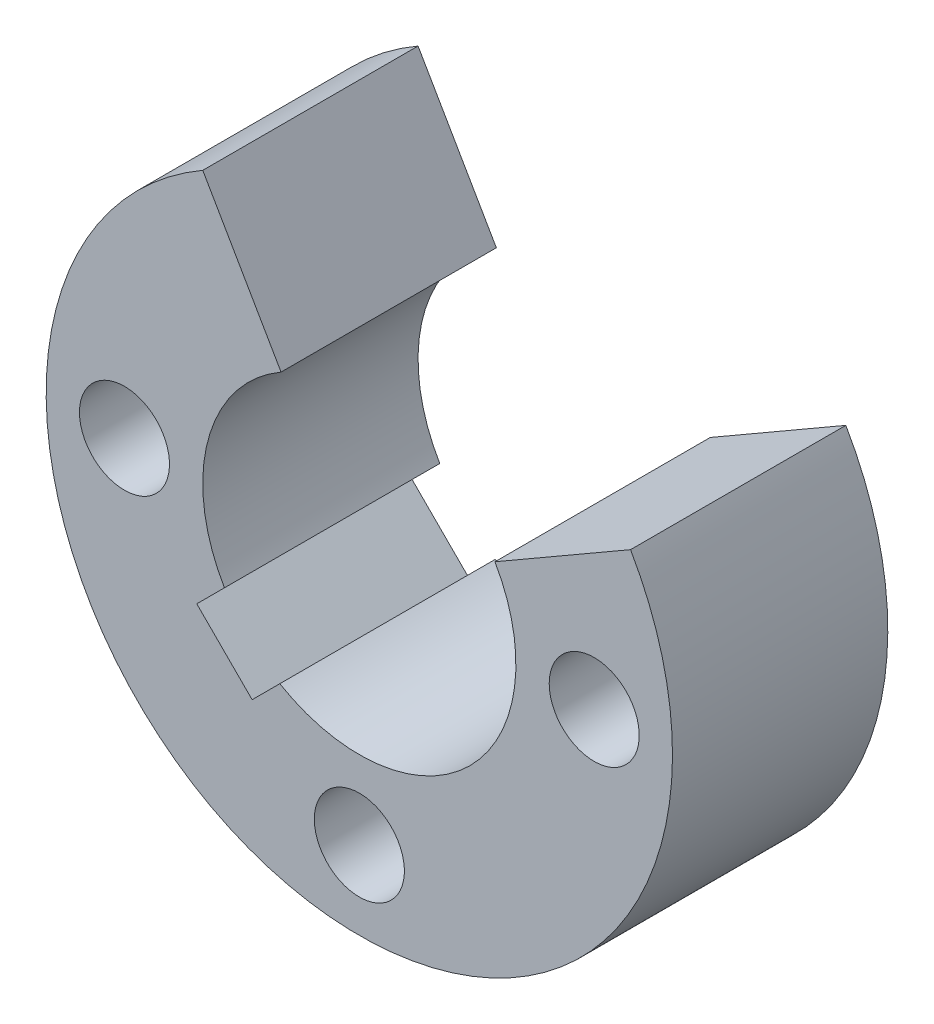
ISO-10303-21;
HEADER;
FILE_DESCRIPTION(('STEP AP214'),'2;1');
FILE_NAME('part.step','',(''),(''),'','','');
FILE_SCHEMA(('AUTOMOTIVE_DESIGN { 1 0 10303 214 1 1 1 1 }'));
ENDSEC;
DATA;
#1=APPLICATION_CONTEXT('core data for automotive mechanical design processes');
#2=APPLICATION_PROTOCOL_DEFINITION('international standard','automotive_design',2000,#1);
#3=PRODUCT_CONTEXT('',#1,'mechanical');
#4=PRODUCT('Part','Part','',(#3));
#5=PRODUCT_RELATED_PRODUCT_CATEGORY('part','',(#4));
#6=PRODUCT_DEFINITION_FORMATION('','',#4);
#7=PRODUCT_DEFINITION_CONTEXT('part definition',#1,'design');
#8=PRODUCT_DEFINITION('design','',#6,#7);
#9=PRODUCT_DEFINITION_SHAPE('','',#8);
#10=(LENGTH_UNIT() NAMED_UNIT(*) SI_UNIT(.MILLI.,.METRE.));
#11=(NAMED_UNIT(*) PLANE_ANGLE_UNIT() SI_UNIT($,.RADIAN.));
#12=(NAMED_UNIT(*) SI_UNIT($,.STERADIAN.) SOLID_ANGLE_UNIT());
#13=UNCERTAINTY_MEASURE_WITH_UNIT(LENGTH_MEASURE(1.E-05),#10,'distance_accuracy_value','');
#14=(GEOMETRIC_REPRESENTATION_CONTEXT(3) GLOBAL_UNCERTAINTY_ASSIGNED_CONTEXT((#13)) GLOBAL_UNIT_ASSIGNED_CONTEXT((#10,
#11,#12)) REPRESENTATION_CONTEXT('',''));
#15=CARTESIAN_POINT('',(0.,0.,0.));
#16=DIRECTION('',(0.,0.,1.));
#17=DIRECTION('',(1.,0.,0.));
#18=AXIS2_PLACEMENT_3D('',#15,#16,#17);
#19=CARTESIAN_POINT('',(-6.,0.,8.));
#20=DIRECTION('',(0.,0.,-1.));
#21=DIRECTION('',(-1.,0.,0.));
#22=AXIS2_PLACEMENT_3D('',#19,#20,#21);
#23=CYLINDRICAL_SURFACE('',#22,1.15);
#24=CARTESIAN_POINT('',(-6.,0.,2.5));
#25=DIRECTION('',(0.,0.,-1.));
#26=DIRECTION('',(-1.,0.,0.));
#27=AXIS2_PLACEMENT_3D('',#24,#25,#26);
#28=CIRCLE('',#27,1.15);
#29=CARTESIAN_POINT('',(-7.15,0.,2.5));
#30=VERTEX_POINT('',#29);
#31=EDGE_CURVE('E39',#30,#30,#28,.T.);
#32=ORIENTED_EDGE('',*,*,#31,.F.);
#33=EDGE_LOOP('',(#32));
#34=FACE_BOUND('',#33,.T.);
#35=CARTESIAN_POINT('',(-6.,0.,-3.));
#36=DIRECTION('',(0.,0.,-1.));
#37=DIRECTION('',(-1.,0.,0.));
#38=AXIS2_PLACEMENT_3D('',#35,#36,#37);
#39=CIRCLE('',#38,1.15);
#40=CARTESIAN_POINT('',(-7.15,0.,-3.));
#41=VERTEX_POINT('',#40);
#42=EDGE_CURVE('E167',#41,#41,#39,.T.);
#43=ORIENTED_EDGE('',*,*,#42,.T.);
#44=EDGE_LOOP('',(#43));
#45=FACE_BOUND('',#44,.T.);
#46=ADVANCED_FACE('F35',(#34,#45),#23,.F.);
#47=CARTESIAN_POINT('',(0.,-6.,8.));
#48=DIRECTION('',(0.,0.,-1.));
#49=DIRECTION('',(-1.,0.,0.));
#50=AXIS2_PLACEMENT_3D('',#47,#48,#49);
#51=CYLINDRICAL_SURFACE('',#50,1.15);
#52=CARTESIAN_POINT('',(0.,-6.,2.5));
#53=DIRECTION('',(0.,0.,-1.));
#54=DIRECTION('',(-1.,0.,0.));
#55=AXIS2_PLACEMENT_3D('',#52,#53,#54);
#56=CIRCLE('',#55,1.15);
#57=CARTESIAN_POINT('',(-1.15,-6.,2.5));
#58=VERTEX_POINT('',#57);
#59=EDGE_CURVE('E176',#58,#58,#56,.T.);
#60=ORIENTED_EDGE('',*,*,#59,.F.);
#61=EDGE_LOOP('',(#60));
#62=FACE_BOUND('',#61,.T.);
#63=CARTESIAN_POINT('',(0.,-6.,-3.));
#64=DIRECTION('',(0.,0.,-1.));
#65=DIRECTION('',(-1.,0.,0.));
#66=AXIS2_PLACEMENT_3D('',#63,#64,#65);
#67=CIRCLE('',#66,1.15);
#68=CARTESIAN_POINT('',(-1.15,-6.,-3.));
#69=VERTEX_POINT('',#68);
#70=EDGE_CURVE('E170',#69,#69,#67,.T.);
#71=ORIENTED_EDGE('',*,*,#70,.T.);
#72=EDGE_LOOP('',(#71));
#73=FACE_BOUND('',#72,.T.);
#74=ADVANCED_FACE('F186',(#62,#73),#51,.F.);
#75=CARTESIAN_POINT('',(6.,0.,8.));
#76=DIRECTION('',(0.,0.,-1.));
#77=DIRECTION('',(-1.,0.,0.));
#78=AXIS2_PLACEMENT_3D('',#75,#76,#77);
#79=CYLINDRICAL_SURFACE('',#78,1.15);
#80=CARTESIAN_POINT('',(6.,0.,2.5));
#81=DIRECTION('',(0.,0.,-1.));
#82=DIRECTION('',(-1.,0.,0.));
#83=AXIS2_PLACEMENT_3D('',#80,#81,#82);
#84=CIRCLE('',#83,1.15);
#85=CARTESIAN_POINT('',(4.85,0.,2.5));
#86=VERTEX_POINT('',#85);
#87=EDGE_CURVE('E154',#86,#86,#84,.T.);
#88=ORIENTED_EDGE('',*,*,#87,.F.);
#89=EDGE_LOOP('',(#88));
#90=FACE_BOUND('',#89,.T.);
#91=CARTESIAN_POINT('',(6.,0.,-3.));
#92=DIRECTION('',(0.,0.,-1.));
#93=DIRECTION('',(-1.,0.,0.));
#94=AXIS2_PLACEMENT_3D('',#91,#92,#93);
#95=CIRCLE('',#94,1.15);
#96=CARTESIAN_POINT('',(4.85,0.,-3.));
#97=VERTEX_POINT('',#96);
#98=EDGE_CURVE('E44',#97,#97,#95,.T.);
#99=ORIENTED_EDGE('',*,*,#98,.T.);
#100=EDGE_LOOP('',(#99));
#101=FACE_BOUND('',#100,.T.);
#102=ADVANCED_FACE('F192',(#90,#101),#79,.F.);
#103=CARTESIAN_POINT('',(0.,0.,-3.));
#104=DIRECTION('',(0.,0.,-1.));
#105=DIRECTION('',(-1.,0.,0.));
#106=AXIS2_PLACEMENT_3D('',#103,#104,#105);
#107=PLANE('',#106);
#108=ORIENTED_EDGE('',*,*,#42,.F.);
#109=EDGE_LOOP('',(#108));
#110=FACE_BOUND('',#109,.T.);
#111=ORIENTED_EDGE('',*,*,#98,.F.);
#112=EDGE_LOOP('',(#111));
#113=FACE_BOUND('',#112,.T.);
#114=ORIENTED_EDGE('',*,*,#70,.F.);
#115=EDGE_LOOP('',(#114));
#116=FACE_BOUND('',#115,.T.);
#117=CARTESIAN_POINT('',(0.,0.,-3.));
#118=DIRECTION('',(0.,0.,-1.));
#119=DIRECTION('',(-1.,0.,0.));
#120=AXIS2_PLACEMENT_3D('',#117,#118,#119);
#121=CIRCLE('',#120,4.);
#122=CARTESIAN_POINT('',(3.46410161513775,2.00000000000001,-3.));
#123=VERTEX_POINT('',#122);
#124=CARTESIAN_POINT('',(-2.0315060063393,-3.44571956871237,-3.));
#125=VERTEX_POINT('',#124);
#126=EDGE_CURVE('E114',#123,#125,#121,.T.);
#127=ORIENTED_EDGE('',*,*,#126,.F.);
#128=DIRECTION('',(0.866025403784438,0.500000000000002,0.));
#129=VECTOR('',#128,1.);
#130=CARTESIAN_POINT('',(0.,0.,-3.));
#131=LINE('',#130,#129);
#132=CARTESIAN_POINT('',(6.9282032302755,4.00000000000002,-3.));
#133=VERTEX_POINT('',#132);
#134=EDGE_CURVE('E144',#123,#133,#131,.T.);
#135=ORIENTED_EDGE('',*,*,#134,.T.);
#136=CARTESIAN_POINT('',(0.,0.,-3.));
#137=DIRECTION('',(0.,0.,-1.));
#138=DIRECTION('',(-1.,0.,0.));
#139=AXIS2_PLACEMENT_3D('',#136,#137,#138);
#140=CIRCLE('',#139,8.);
#141=CARTESIAN_POINT('',(-3.99999999999999,6.92820323027551,-3.));
#142=VERTEX_POINT('',#141);
#143=EDGE_CURVE('E12',#133,#142,#140,.T.);
#144=ORIENTED_EDGE('',*,*,#143,.T.);
#145=DIRECTION('',(0.499999999999999,-0.866025403784439,0.));
#146=VECTOR('',#145,1.);
#147=CARTESIAN_POINT('',(0.,0.,-3.));
#148=LINE('',#147,#146);
#149=CARTESIAN_POINT('',(-2.,3.46410161513776,-3.));
#150=VERTEX_POINT('',#149);
#151=EDGE_CURVE('E141',#142,#150,#148,.T.);
#152=ORIENTED_EDGE('',*,*,#151,.T.);
#153=CARTESIAN_POINT('',(0.,0.,-3.));
#154=DIRECTION('',(0.,0.,-1.));
#155=DIRECTION('',(-1.,0.,0.));
#156=AXIS2_PLACEMENT_3D('',#153,#154,#155);
#157=CIRCLE('',#156,4.);
#158=CARTESIAN_POINT('',(-3.44571956871239,-2.03150600633926,-3.));
#159=VERTEX_POINT('',#158);
#160=EDGE_CURVE('E139',#159,#150,#157,.T.);
#161=ORIENTED_EDGE('',*,*,#160,.F.);
#162=DIRECTION('',(0.707106781186551,0.707106781186545,0.));
#163=VECTOR('',#162,1.);
#164=CARTESIAN_POINT('',(-0.707106781186547,0.707106781186553,-3.));
#165=LINE('',#164,#163);
#166=CARTESIAN_POINT('',(-4.15282634989894,-2.73861278752581,-3.));
#167=VERTEX_POINT('',#166);
#168=EDGE_CURVE('E137',#167,#159,#165,.T.);
#169=ORIENTED_EDGE('',*,*,#168,.F.);
#170=DIRECTION('',(-0.707106781186544,0.707106781186551,0.));
#171=VECTOR('',#170,1.);
#172=CARTESIAN_POINT('',(-3.4457195687124,-3.44571956871236,-3.));
#173=LINE('',#172,#171);
#174=CARTESIAN_POINT('',(-2.73861278752585,-4.15282634989891,-3.));
#175=VERTEX_POINT('',#174);
#176=EDGE_CURVE('E150',#175,#167,#173,.T.);
#177=ORIENTED_EDGE('',*,*,#176,.F.);
#178=DIRECTION('',(-0.707106781186551,-0.707106781186544,0.));
#179=VECTOR('',#178,1.);
#180=CARTESIAN_POINT('',(0.707106781186545,-0.707106781186553,-3.));
#181=LINE('',#180,#179);
#182=EDGE_CURVE('E148',#125,#175,#181,.T.);
#183=ORIENTED_EDGE('',*,*,#182,.F.);
#184=EDGE_LOOP('',(#127,#135,#144,#152,#161,#169,#177,#183));
#185=FACE_BOUND('',#184,.T.);
#186=ADVANCED_FACE('F189',(#110,#113,#116,#185),#107,.T.);
#187=CARTESIAN_POINT('',(0.,0.,2.5));
#188=DIRECTION('',(0.,0.,-1.));
#189=DIRECTION('',(-1.,0.,0.));
#190=AXIS2_PLACEMENT_3D('',#187,#188,#189);
#191=PLANE('',#190);
#192=ORIENTED_EDGE('',*,*,#87,.T.);
#193=EDGE_LOOP('',(#192));
#194=FACE_BOUND('',#193,.T.);
#195=ORIENTED_EDGE('',*,*,#59,.T.);
#196=EDGE_LOOP('',(#195));
#197=FACE_BOUND('',#196,.T.);
#198=ORIENTED_EDGE('',*,*,#31,.T.);
#199=EDGE_LOOP('',(#198));
#200=FACE_BOUND('',#199,.T.);
#201=DIRECTION('',(0.866025403784438,0.500000000000002,0.));
#202=VECTOR('',#201,1.);
#203=CARTESIAN_POINT('',(0.,0.,2.5));
#204=LINE('',#203,#202);
#205=CARTESIAN_POINT('',(3.46410161513775,2.00000000000001,2.5));
#206=VERTEX_POINT('',#205);
#207=CARTESIAN_POINT('',(6.9282032302755,4.00000000000002,2.5));
#208=VERTEX_POINT('',#207);
#209=EDGE_CURVE('E130',#206,#208,#204,.T.);
#210=ORIENTED_EDGE('',*,*,#209,.F.);
#211=CARTESIAN_POINT('',(0.,0.,2.5));
#212=DIRECTION('',(0.,0.,-1.));
#213=DIRECTION('',(-1.,0.,0.));
#214=AXIS2_PLACEMENT_3D('',#211,#212,#213);
#215=CIRCLE('',#214,4.);
#216=CARTESIAN_POINT('',(-2.0315060063393,-3.44571956871237,2.5));
#217=VERTEX_POINT('',#216);
#218=EDGE_CURVE('E111',#206,#217,#215,.T.);
#219=ORIENTED_EDGE('',*,*,#218,.T.);
#220=DIRECTION('',(-0.707106781186551,-0.707106781186544,0.));
#221=VECTOR('',#220,1.);
#222=CARTESIAN_POINT('',(0.707106781186545,-0.707106781186553,2.5));
#223=LINE('',#222,#221);
#224=CARTESIAN_POINT('',(-2.73861278752585,-4.15282634989891,2.5));
#225=VERTEX_POINT('',#224);
#226=EDGE_CURVE('E122',#217,#225,#223,.T.);
#227=ORIENTED_EDGE('',*,*,#226,.T.);
#228=DIRECTION('',(-0.707106781186544,0.707106781186551,0.));
#229=VECTOR('',#228,1.);
#230=CARTESIAN_POINT('',(-3.4457195687124,-3.44571956871236,2.5));
#231=LINE('',#230,#229);
#232=CARTESIAN_POINT('',(-4.15282634989894,-2.73861278752581,2.5));
#233=VERTEX_POINT('',#232);
#234=EDGE_CURVE('E126',#225,#233,#231,.T.);
#235=ORIENTED_EDGE('',*,*,#234,.T.);
#236=DIRECTION('',(0.707106781186551,0.707106781186545,0.));
#237=VECTOR('',#236,1.);
#238=CARTESIAN_POINT('',(-0.707106781186547,0.707106781186553,2.5));
#239=LINE('',#238,#237);
#240=CARTESIAN_POINT('',(-3.44571956871239,-2.03150600633926,2.5));
#241=VERTEX_POINT('',#240);
#242=EDGE_CURVE('E152',#233,#241,#239,.T.);
#243=ORIENTED_EDGE('',*,*,#242,.T.);
#244=CARTESIAN_POINT('',(0.,0.,2.5));
#245=DIRECTION('',(0.,0.,-1.));
#246=DIRECTION('',(-1.,0.,0.));
#247=AXIS2_PLACEMENT_3D('',#244,#245,#246);
#248=CIRCLE('',#247,4.);
#249=CARTESIAN_POINT('',(-2.,3.46410161513776,2.5));
#250=VERTEX_POINT('',#249);
#251=EDGE_CURVE('E207',#241,#250,#248,.T.);
#252=ORIENTED_EDGE('',*,*,#251,.T.);
#253=DIRECTION('',(0.499999999999999,-0.866025403784439,0.));
#254=VECTOR('',#253,1.);
#255=CARTESIAN_POINT('',(0.,0.,2.5));
#256=LINE('',#255,#254);
#257=CARTESIAN_POINT('',(-3.99999999999999,6.92820323027551,2.5));
#258=VERTEX_POINT('',#257);
#259=EDGE_CURVE('E132',#258,#250,#256,.T.);
#260=ORIENTED_EDGE('',*,*,#259,.F.);
#261=CARTESIAN_POINT('',(0.,0.,2.5));
#262=DIRECTION('',(0.,0.,-1.));
#263=DIRECTION('',(-1.,0.,0.));
#264=AXIS2_PLACEMENT_3D('',#261,#262,#263);
#265=CIRCLE('',#264,8.);
#266=EDGE_CURVE('E164',#208,#258,#265,.T.);
#267=ORIENTED_EDGE('',*,*,#266,.F.);
#268=EDGE_LOOP('',(#210,#219,#227,#235,#243,#252,#260,#267));
#269=FACE_BOUND('',#268,.T.);
#270=ADVANCED_FACE('F128',(#194,#197,#200,#269),#191,.F.);
#271=CARTESIAN_POINT('',(0.,0.,8.));
#272=DIRECTION('',(0.,0.,-1.));
#273=DIRECTION('',(-1.,0.,0.));
#274=AXIS2_PLACEMENT_3D('',#271,#272,#273);
#275=CYLINDRICAL_SURFACE('',#274,8.);
#276=DIRECTION('',(0.,0.,-1.));
#277=VECTOR('',#276,1.);
#278=CARTESIAN_POINT('',(6.9282032302755,4.00000000000002,2.5));
#279=LINE('',#278,#277);
#280=EDGE_CURVE('E157',#208,#133,#279,.T.);
#281=ORIENTED_EDGE('',*,*,#280,.F.);
#282=ORIENTED_EDGE('',*,*,#266,.T.);
#283=DIRECTION('',(0.,0.,-1.));
#284=VECTOR('',#283,1.);
#285=CARTESIAN_POINT('',(-3.99999999999999,6.92820323027551,2.5));
#286=LINE('',#285,#284);
#287=EDGE_CURVE('E159',#258,#142,#286,.T.);
#288=ORIENTED_EDGE('',*,*,#287,.T.);
#289=ORIENTED_EDGE('',*,*,#143,.F.);
#290=EDGE_LOOP('',(#281,#282,#288,#289));
#291=FACE_BOUND('',#290,.T.);
#292=ADVANCED_FACE('F37',(#291),#275,.T.);
#293=CARTESIAN_POINT('',(0.,0.,2.5));
#294=DIRECTION('',(0.,0.,-1.));
#295=DIRECTION('',(-1.,0.,0.));
#296=AXIS2_PLACEMENT_3D('',#293,#294,#295);
#297=CYLINDRICAL_SURFACE('',#296,4.);
#298=ORIENTED_EDGE('',*,*,#160,.T.);
#299=DIRECTION('',(0.,0.,-1.));
#300=VECTOR('',#299,1.);
#301=CARTESIAN_POINT('',(-2.,3.46410161513776,2.5));
#302=LINE('',#301,#300);
#303=EDGE_CURVE('E52',#250,#150,#302,.T.);
#304=ORIENTED_EDGE('',*,*,#303,.F.);
#305=ORIENTED_EDGE('',*,*,#251,.F.);
#306=DIRECTION('',(0.,0.,-1.));
#307=VECTOR('',#306,1.);
#308=CARTESIAN_POINT('',(-3.44571956871239,-2.03150600633926,2.5));
#309=LINE('',#308,#307);
#310=EDGE_CURVE('E94',#241,#159,#309,.T.);
#311=ORIENTED_EDGE('',*,*,#310,.T.);
#312=EDGE_LOOP('',(#298,#304,#305,#311));
#313=FACE_BOUND('',#312,.T.);
#314=ADVANCED_FACE('F223',(#313),#297,.F.);
#315=CARTESIAN_POINT('',(0.,0.,2.5));
#316=DIRECTION('',(0.866025403784439,0.499999999999999,0.));
#317=DIRECTION('',(-0.499999999999999,0.866025403784439,0.));
#318=AXIS2_PLACEMENT_3D('',#315,#316,#317);
#319=PLANE('',#318);
#320=ORIENTED_EDGE('',*,*,#151,.F.);
#321=ORIENTED_EDGE('',*,*,#287,.F.);
#322=ORIENTED_EDGE('',*,*,#259,.T.);
#323=ORIENTED_EDGE('',*,*,#303,.T.);
#324=EDGE_LOOP('',(#320,#321,#322,#323));
#325=FACE_BOUND('',#324,.T.);
#326=ADVANCED_FACE('F211',(#325),#319,.T.);
#327=CARTESIAN_POINT('',(0.,0.,2.5));
#328=DIRECTION('',(-0.500000000000002,0.866025403784438,0.));
#329=DIRECTION('',(-0.866025403784438,-0.500000000000002,0.));
#330=AXIS2_PLACEMENT_3D('',#327,#328,#329);
#331=PLANE('',#330);
#332=ORIENTED_EDGE('',*,*,#134,.F.);
#333=DIRECTION('',(0.,0.,-1.));
#334=VECTOR('',#333,1.);
#335=CARTESIAN_POINT('',(3.46410161513775,2.00000000000001,2.5));
#336=LINE('',#335,#334);
#337=EDGE_CURVE('E119',#206,#123,#336,.T.);
#338=ORIENTED_EDGE('',*,*,#337,.F.);
#339=ORIENTED_EDGE('',*,*,#209,.T.);
#340=ORIENTED_EDGE('',*,*,#280,.T.);
#341=EDGE_LOOP('',(#332,#338,#339,#340));
#342=FACE_BOUND('',#341,.T.);
#343=ADVANCED_FACE('F215',(#342),#331,.T.);
#344=CARTESIAN_POINT('',(0.,0.,2.5));
#345=DIRECTION('',(0.,0.,-1.));
#346=DIRECTION('',(-1.,0.,0.));
#347=AXIS2_PLACEMENT_3D('',#344,#345,#346);
#348=CYLINDRICAL_SURFACE('',#347,4.);
#349=ORIENTED_EDGE('',*,*,#126,.T.);
#350=DIRECTION('',(0.,0.,-1.));
#351=VECTOR('',#350,1.);
#352=CARTESIAN_POINT('',(-2.0315060063393,-3.44571956871237,2.5));
#353=LINE('',#352,#351);
#354=EDGE_CURVE('E107',#217,#125,#353,.T.);
#355=ORIENTED_EDGE('',*,*,#354,.F.);
#356=ORIENTED_EDGE('',*,*,#218,.F.);
#357=ORIENTED_EDGE('',*,*,#337,.T.);
#358=EDGE_LOOP('',(#349,#355,#356,#357));
#359=FACE_BOUND('',#358,.T.);
#360=ADVANCED_FACE('F109',(#359),#348,.F.);
#361=CARTESIAN_POINT('',(0.707106781186545,-0.707106781186553,2.5));
#362=DIRECTION('',(0.707106781186544,-0.707106781186551,0.));
#363=DIRECTION('',(0.707106781186551,0.707106781186544,0.));
#364=AXIS2_PLACEMENT_3D('',#361,#362,#363);
#365=PLANE('',#364);
#366=ORIENTED_EDGE('',*,*,#182,.T.);
#367=DIRECTION('',(0.,0.,-1.));
#368=VECTOR('',#367,1.);
#369=CARTESIAN_POINT('',(-2.73861278752585,-4.15282634989891,2.5));
#370=LINE('',#369,#368);
#371=EDGE_CURVE('E118',#225,#175,#370,.T.);
#372=ORIENTED_EDGE('',*,*,#371,.F.);
#373=ORIENTED_EDGE('',*,*,#226,.F.);
#374=ORIENTED_EDGE('',*,*,#354,.T.);
#375=EDGE_LOOP('',(#366,#372,#373,#374));
#376=FACE_BOUND('',#375,.T.);
#377=ADVANCED_FACE('F123',(#376),#365,.F.);
#378=CARTESIAN_POINT('',(-3.4457195687124,-3.44571956871236,2.5));
#379=DIRECTION('',(-0.707106781186551,-0.707106781186544,0.));
#380=DIRECTION('',(0.707106781186544,-0.707106781186551,0.));
#381=AXIS2_PLACEMENT_3D('',#378,#379,#380);
#382=PLANE('',#381);
#383=ORIENTED_EDGE('',*,*,#176,.T.);
#384=DIRECTION('',(0.,0.,-1.));
#385=VECTOR('',#384,1.);
#386=CARTESIAN_POINT('',(-4.15282634989894,-2.73861278752581,2.5));
#387=LINE('',#386,#385);
#388=EDGE_CURVE('E61',#233,#167,#387,.T.);
#389=ORIENTED_EDGE('',*,*,#388,.F.);
#390=ORIENTED_EDGE('',*,*,#234,.F.);
#391=ORIENTED_EDGE('',*,*,#371,.T.);
#392=EDGE_LOOP('',(#383,#389,#390,#391));
#393=FACE_BOUND('',#392,.T.);
#394=ADVANCED_FACE('F203',(#393),#382,.F.);
#395=CARTESIAN_POINT('',(-0.707106781186547,0.707106781186553,2.5));
#396=DIRECTION('',(-0.707106781186544,0.70710678118655,0.));
#397=DIRECTION('',(-0.707106781186551,-0.707106781186545,0.));
#398=AXIS2_PLACEMENT_3D('',#395,#396,#397);
#399=PLANE('',#398);
#400=ORIENTED_EDGE('',*,*,#168,.T.);
#401=ORIENTED_EDGE('',*,*,#310,.F.);
#402=ORIENTED_EDGE('',*,*,#242,.F.);
#403=ORIENTED_EDGE('',*,*,#388,.T.);
#404=EDGE_LOOP('',(#400,#401,#402,#403));
#405=FACE_BOUND('',#404,.T.);
#406=ADVANCED_FACE('F229',(#405),#399,.F.);
#407=CLOSED_SHELL('',(#46,#74,#102,#186,#270,#292,#314,#326,#343,#360,#377,#394,#406));
#408=MANIFOLD_SOLID_BREP('B2',#407);
#409=ADVANCED_BREP_SHAPE_REPRESENTATION('',(#18,#408),#14);
#410=SHAPE_DEFINITION_REPRESENTATION(#9,#409);
ENDSEC;
END-ISO-10303-21;
